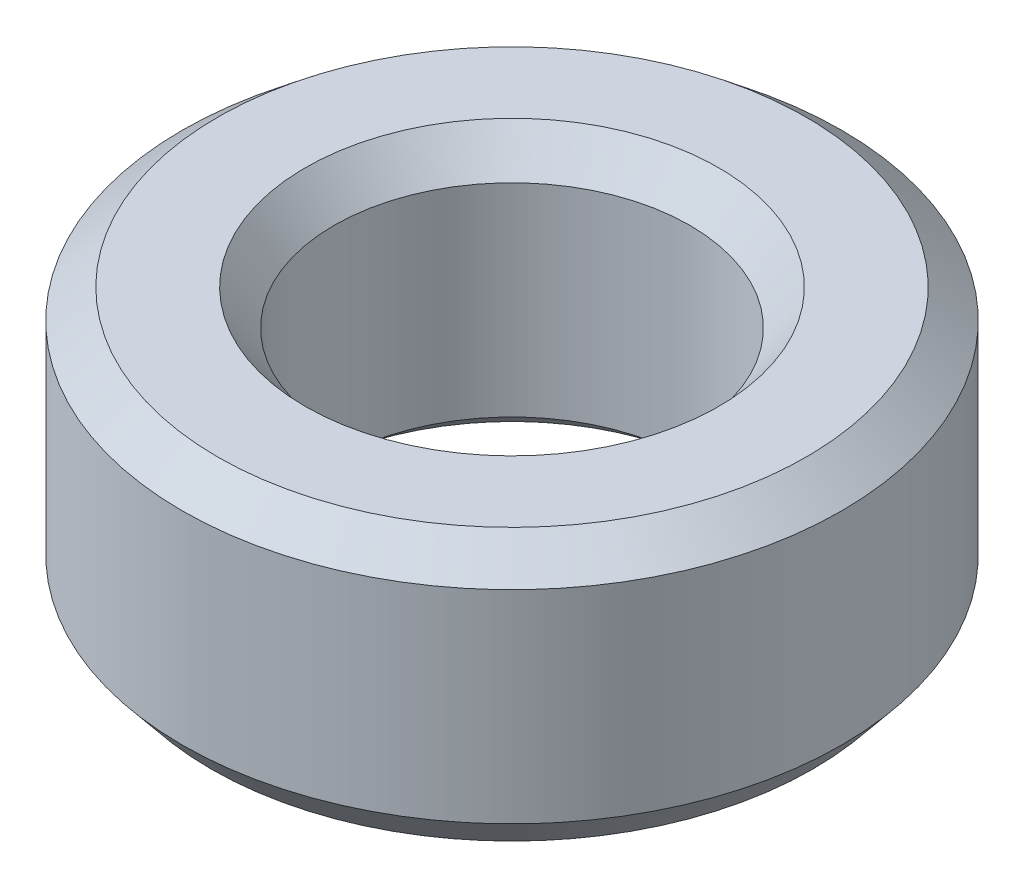
ISO-10303-21;
HEADER;
FILE_DESCRIPTION(('STEP AP214'),'2;1');
FILE_NAME('part.step','',(''),(''),'','','');
FILE_SCHEMA(('AUTOMOTIVE_DESIGN { 1 0 10303 214 1 1 1 1 }'));
ENDSEC;
DATA;
#1=APPLICATION_CONTEXT('core data for automotive mechanical design processes');
#2=APPLICATION_PROTOCOL_DEFINITION('international standard','automotive_design',2000,#1);
#3=PRODUCT_CONTEXT('',#1,'mechanical');
#4=PRODUCT('Part','Part','',(#3));
#5=PRODUCT_RELATED_PRODUCT_CATEGORY('part','',(#4));
#6=PRODUCT_DEFINITION_FORMATION('','',#4);
#7=PRODUCT_DEFINITION_CONTEXT('part definition',#1,'design');
#8=PRODUCT_DEFINITION('design','',#6,#7);
#9=PRODUCT_DEFINITION_SHAPE('','',#8);
#10=(LENGTH_UNIT() NAMED_UNIT(*) SI_UNIT(.MILLI.,.METRE.));
#11=(NAMED_UNIT(*) PLANE_ANGLE_UNIT() SI_UNIT($,.RADIAN.));
#12=(NAMED_UNIT(*) SI_UNIT($,.STERADIAN.) SOLID_ANGLE_UNIT());
#13=UNCERTAINTY_MEASURE_WITH_UNIT(LENGTH_MEASURE(1.E-05),#10,'distance_accuracy_value','');
#14=(GEOMETRIC_REPRESENTATION_CONTEXT(3) GLOBAL_UNCERTAINTY_ASSIGNED_CONTEXT((#13)) GLOBAL_UNIT_ASSIGNED_CONTEXT((#10,
#11,#12)) REPRESENTATION_CONTEXT('',''));
#15=CARTESIAN_POINT('',(0.,0.,0.));
#16=DIRECTION('',(0.,0.,1.));
#17=DIRECTION('',(1.,0.,0.));
#18=AXIS2_PLACEMENT_3D('',#15,#16,#17);
#19=CARTESIAN_POINT('',(0.,22.2829237688546,0.));
#20=DIRECTION('',(0.,-1.,0.));
#21=DIRECTION('',(0.,0.,-1.));
#22=AXIS2_PLACEMENT_3D('',#19,#20,#21);
#23=CYLINDRICAL_SURFACE('',#22,27.5);
#24=CARTESIAN_POINT('',(0.,2.95231782428351,0.));
#25=DIRECTION('',(0.,1.,0.));
#26=DIRECTION('',(0.,0.,1.));
#27=AXIS2_PLACEMENT_3D('',#24,#25,#26);
#28=CIRCLE('',#27,27.5);
#29=CARTESIAN_POINT('',(0.,2.95231782428351,27.5));
#30=VERTEX_POINT('',#29);
#31=EDGE_CURVE('E10',#30,#30,#28,.T.);
#32=ORIENTED_EDGE('',*,*,#31,.T.);
#33=EDGE_LOOP('',(#32));
#34=FACE_BOUND('',#33,.T.);
#35=CARTESIAN_POINT('',(0.,19.8680424581464,0.));
#36=DIRECTION('',(0.,1.,0.));
#37=DIRECTION('',(0.,0.,1.));
#38=AXIS2_PLACEMENT_3D('',#35,#36,#37);
#39=CIRCLE('',#38,27.5);
#40=CARTESIAN_POINT('',(0.,19.8680424581464,27.5));
#41=VERTEX_POINT('',#40);
#42=EDGE_CURVE('E50',#41,#41,#39,.F.);
#43=ORIENTED_EDGE('',*,*,#42,.T.);
#44=EDGE_LOOP('',(#43));
#45=FACE_BOUND('',#44,.T.);
#46=ADVANCED_FACE('F39',(#34,#45),#23,.T.);
#47=CARTESIAN_POINT('',(0.,22.2829237688546,0.));
#48=DIRECTION('',(0.,1.,0.));
#49=DIRECTION('',(0.,0.,1.));
#50=AXIS2_PLACEMENT_3D('',#47,#48,#49);
#51=PLANE('',#50);
#52=CARTESIAN_POINT('',(0.,22.2829237688546,0.));
#53=DIRECTION('',(0.,1.,0.));
#54=DIRECTION('',(0.,0.,1.));
#55=AXIS2_PLACEMENT_3D('',#52,#53,#54);
#56=CIRCLE('',#55,17.245119197406);
#57=CARTESIAN_POINT('',(0.,22.2829237688546,17.245119197406));
#58=VERTEX_POINT('',#57);
#59=EDGE_CURVE('E58',#58,#58,#56,.F.);
#60=ORIENTED_EDGE('',*,*,#59,.T.);
#61=EDGE_LOOP('',(#60));
#62=FACE_BOUND('',#61,.T.);
#63=CARTESIAN_POINT('',(0.,22.2829237688546,0.));
#64=DIRECTION('',(0.,1.,0.));
#65=DIRECTION('',(0.,0.,1.));
#66=AXIS2_PLACEMENT_3D('',#63,#64,#65);
#67=CIRCLE('',#66,24.5476821757165);
#68=CARTESIAN_POINT('',(0.,22.2829237688546,24.5476821757165));
#69=VERTEX_POINT('',#68);
#70=EDGE_CURVE('E61',#69,#69,#67,.T.);
#71=ORIENTED_EDGE('',*,*,#70,.T.);
#72=EDGE_LOOP('',(#71));
#73=FACE_BOUND('',#72,.T.);
#74=ADVANCED_FACE('F88',(#62,#73),#51,.T.);
#75=CARTESIAN_POINT('',(0.,0.,0.));
#76=DIRECTION('',(0.,1.,0.));
#77=DIRECTION('',(0.,0.,1.));
#78=AXIS2_PLACEMENT_3D('',#75,#76,#77);
#79=PLANE('',#78);
#80=CARTESIAN_POINT('',(0.,0.,0.));
#81=DIRECTION('',(0.,1.,0.));
#82=DIRECTION('',(0.,0.,1.));
#83=AXIS2_PLACEMENT_3D('',#80,#81,#82);
#84=CIRCLE('',#83,17.7825557109813);
#85=CARTESIAN_POINT('',(0.,0.,17.7825557109813));
#86=VERTEX_POINT('',#85);
#87=EDGE_CURVE('E51',#86,#86,#84,.T.);
#88=ORIENTED_EDGE('',*,*,#87,.T.);
#89=EDGE_LOOP('',(#88));
#90=FACE_BOUND('',#89,.T.);
#91=CARTESIAN_POINT('',(0.,0.,0.));
#92=DIRECTION('',(0.,1.,0.));
#93=DIRECTION('',(0.,0.,1.));
#94=AXIS2_PLACEMENT_3D('',#91,#92,#93);
#95=CIRCLE('',#94,25.0851186892918);
#96=CARTESIAN_POINT('',(0.,0.,25.0851186892918));
#97=VERTEX_POINT('',#96);
#98=EDGE_CURVE('E54',#97,#97,#95,.F.);
#99=ORIENTED_EDGE('',*,*,#98,.T.);
#100=EDGE_LOOP('',(#99));
#101=FACE_BOUND('',#100,.T.);
#102=ADVANCED_FACE('F83',(#90,#101),#79,.F.);
#103=CARTESIAN_POINT('',(0.,22.2829237688546,0.));
#104=DIRECTION('',(0.,-1.,0.));
#105=DIRECTION('',(0.,0.,-1.));
#106=AXIS2_PLACEMENT_3D('',#103,#104,#105);
#107=CYLINDRICAL_SURFACE('',#106,14.8302378866978);
#108=CARTESIAN_POINT('',(0.,19.330605944571,0.));
#109=DIRECTION('',(0.,1.,0.));
#110=DIRECTION('',(0.,0.,1.));
#111=AXIS2_PLACEMENT_3D('',#108,#109,#110);
#112=CIRCLE('',#111,14.8302378866978);
#113=CARTESIAN_POINT('',(0.,19.330605944571,14.8302378866978));
#114=VERTEX_POINT('',#113);
#115=EDGE_CURVE('E67',#114,#114,#112,.T.);
#116=ORIENTED_EDGE('',*,*,#115,.T.);
#117=EDGE_LOOP('',(#116));
#118=FACE_BOUND('',#117,.T.);
#119=CARTESIAN_POINT('',(0.,2.41488131070818,0.));
#120=DIRECTION('',(0.,1.,0.));
#121=DIRECTION('',(0.,0.,1.));
#122=AXIS2_PLACEMENT_3D('',#119,#120,#121);
#123=CIRCLE('',#122,14.8302378866978);
#124=CARTESIAN_POINT('',(0.,2.41488131070818,14.8302378866978));
#125=VERTEX_POINT('',#124);
#126=EDGE_CURVE('E69',#125,#125,#123,.F.);
#127=ORIENTED_EDGE('',*,*,#126,.T.);
#128=EDGE_LOOP('',(#127));
#129=FACE_BOUND('',#128,.T.);
#130=ADVANCED_FACE('F71',(#118,#129),#107,.F.);
#131=CARTESIAN_POINT('',(0.,19.330605944571,0.));
#132=DIRECTION('',(0.,1.,0.));
#133=DIRECTION('',(0.,0.,1.));
#134=AXIS2_PLACEMENT_3D('',#131,#132,#133);
#135=CONICAL_SURFACE('',#134,14.8302378866978,0.685597319864946);
#136=ORIENTED_EDGE('',*,*,#59,.F.);
#137=EDGE_LOOP('',(#136));
#138=FACE_BOUND('',#137,.T.);
#139=ORIENTED_EDGE('',*,*,#115,.F.);
#140=EDGE_LOOP('',(#139));
#141=FACE_BOUND('',#140,.T.);
#142=ADVANCED_FACE('F77',(#138,#141),#135,.F.);
#143=CARTESIAN_POINT('',(0.,0.,0.));
#144=DIRECTION('',(0.,-1.,0.));
#145=DIRECTION('',(0.,0.,-1.));
#146=AXIS2_PLACEMENT_3D('',#143,#144,#145);
#147=CONICAL_SURFACE('',#146,17.7825557109813,0.885199006929952);
#148=ORIENTED_EDGE('',*,*,#126,.F.);
#149=EDGE_LOOP('',(#148));
#150=FACE_BOUND('',#149,.T.);
#151=ORIENTED_EDGE('',*,*,#87,.F.);
#152=EDGE_LOOP('',(#151));
#153=FACE_BOUND('',#152,.T.);
#154=ADVANCED_FACE('F73',(#150,#153),#147,.F.);
#155=CARTESIAN_POINT('',(0.,2.95231782428351,0.));
#156=DIRECTION('',(0.,1.,0.));
#157=DIRECTION('',(0.,0.,1.));
#158=AXIS2_PLACEMENT_3D('',#155,#156,#157);
#159=CONICAL_SURFACE('',#158,27.5,0.685597319864946);
#160=ORIENTED_EDGE('',*,*,#98,.F.);
#161=EDGE_LOOP('',(#160));
#162=FACE_BOUND('',#161,.T.);
#163=ORIENTED_EDGE('',*,*,#31,.F.);
#164=EDGE_LOOP('',(#163));
#165=FACE_BOUND('',#164,.T.);
#166=ADVANCED_FACE('F76',(#162,#165),#159,.T.);
#167=CARTESIAN_POINT('',(0.,22.2829237688546,0.));
#168=DIRECTION('',(0.,-1.,0.));
#169=DIRECTION('',(0.,0.,-1.));
#170=AXIS2_PLACEMENT_3D('',#167,#168,#169);
#171=CONICAL_SURFACE('',#170,24.5476821757165,0.885199006929954);
#172=ORIENTED_EDGE('',*,*,#42,.F.);
#173=EDGE_LOOP('',(#172));
#174=FACE_BOUND('',#173,.T.);
#175=ORIENTED_EDGE('',*,*,#70,.F.);
#176=EDGE_LOOP('',(#175));
#177=FACE_BOUND('',#176,.T.);
#178=ADVANCED_FACE('F45',(#174,#177),#171,.T.);
#179=CLOSED_SHELL('',(#46,#74,#102,#130,#142,#154,#166,#178));
#180=MANIFOLD_SOLID_BREP('B2',#179);
#181=ADVANCED_BREP_SHAPE_REPRESENTATION('',(#18,#180),#14);
#182=SHAPE_DEFINITION_REPRESENTATION(#9,#181);
ENDSEC;
END-ISO-10303-21;
